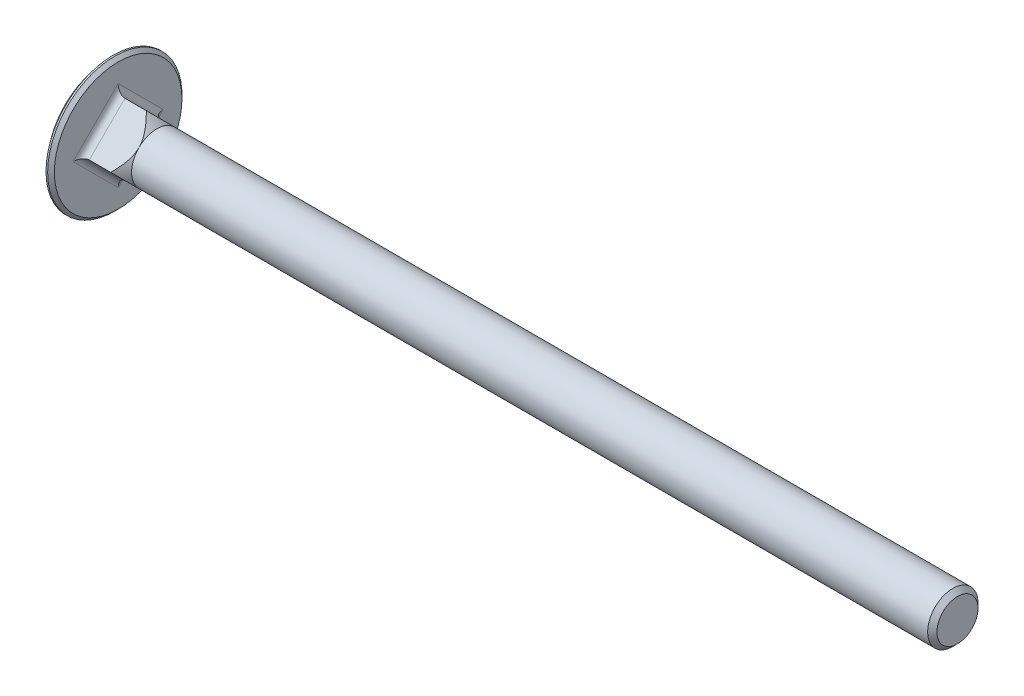
ISO-10303-21;
HEADER;
FILE_DESCRIPTION(('STEP AP214'),'2;1');
FILE_NAME('part.step','',(''),(''),'','','');
FILE_SCHEMA(('AUTOMOTIVE_DESIGN { 1 0 10303 214 1 1 1 1 }'));
ENDSEC;
DATA;
#1=APPLICATION_CONTEXT('core data for automotive mechanical design processes');
#2=APPLICATION_PROTOCOL_DEFINITION('international standard','automotive_design',2000,#1);
#3=PRODUCT_CONTEXT('',#1,'mechanical');
#4=PRODUCT('Part','Part','',(#3));
#5=PRODUCT_RELATED_PRODUCT_CATEGORY('part','',(#4));
#6=PRODUCT_DEFINITION_FORMATION('','',#4);
#7=PRODUCT_DEFINITION_CONTEXT('part definition',#1,'design');
#8=PRODUCT_DEFINITION('design','',#6,#7);
#9=PRODUCT_DEFINITION_SHAPE('','',#8);
#10=(LENGTH_UNIT() NAMED_UNIT(*) SI_UNIT(.MILLI.,.METRE.));
#11=(NAMED_UNIT(*) PLANE_ANGLE_UNIT() SI_UNIT($,.RADIAN.));
#12=(NAMED_UNIT(*) SI_UNIT($,.STERADIAN.) SOLID_ANGLE_UNIT());
#13=UNCERTAINTY_MEASURE_WITH_UNIT(LENGTH_MEASURE(1.E-05),#10,'distance_accuracy_value','');
#14=(GEOMETRIC_REPRESENTATION_CONTEXT(3) GLOBAL_UNCERTAINTY_ASSIGNED_CONTEXT((#13)) GLOBAL_UNIT_ASSIGNED_CONTEXT((#10,
#11,#12)) REPRESENTATION_CONTEXT('',''));
#15=CARTESIAN_POINT('',(0.,0.,0.));
#16=DIRECTION('',(0.,0.,1.));
#17=DIRECTION('',(1.,0.,0.));
#18=AXIS2_PLACEMENT_3D('',#15,#16,#17);
#19=CARTESIAN_POINT('',(-31.75,0.,0.));
#20=DIRECTION('',(-1.,0.,0.));
#21=DIRECTION('',(0.,0.,1.));
#22=AXIS2_PLACEMENT_3D('',#19,#20,#21);
#23=CYLINDRICAL_SURFACE('',#22,2.99999999999999);
#24=CARTESIAN_POINT('',(8.2,0.,0.));
#25=DIRECTION('',(-1.,0.,0.));
#26=DIRECTION('',(0.,0.,1.));
#27=AXIS2_PLACEMENT_3D('',#24,#25,#26);
#28=CIRCLE('',#27,2.99999999999999);
#29=CARTESIAN_POINT('',(8.2,2.12132034355964,2.12132034355964));
#30=VERTEX_POINT('',#29);
#31=CARTESIAN_POINT('',(8.2,-2.12132034355964,2.12132034355964));
#32=VERTEX_POINT('',#31);
#33=EDGE_CURVE('E130',#30,#32,#28,.F.);
#34=ORIENTED_EDGE('',*,*,#33,.T.);
#35=CARTESIAN_POINT('',(8.2,-2.12132034355964,-2.12132034355964));
#36=VERTEX_POINT('',#35);
#37=EDGE_CURVE('E140',#32,#36,#28,.F.);
#38=ORIENTED_EDGE('',*,*,#37,.T.);
#39=CARTESIAN_POINT('',(8.2,2.12132034355964,-2.12132034355964));
#40=VERTEX_POINT('',#39);
#41=EDGE_CURVE('E143',#36,#40,#28,.F.);
#42=ORIENTED_EDGE('',*,*,#41,.T.);
#43=EDGE_CURVE('E115',#40,#30,#28,.F.);
#44=ORIENTED_EDGE('',*,*,#43,.T.);
#45=EDGE_LOOP('',(#34,#38,#42,#44));
#46=FACE_BOUND('',#45,.T.);
#47=CARTESIAN_POINT('',(103.0455,0.,0.));
#48=DIRECTION('',(-1.,0.,0.));
#49=DIRECTION('',(0.,0.,1.));
#50=AXIS2_PLACEMENT_3D('',#47,#48,#49);
#51=CIRCLE('',#50,2.99999999999998);
#52=CARTESIAN_POINT('',(103.0455,0.,2.99999999999998));
#53=VERTEX_POINT('',#52);
#54=EDGE_CURVE('E285',#53,#53,#51,.T.);
#55=ORIENTED_EDGE('',*,*,#54,.T.);
#56=EDGE_LOOP('',(#55));
#57=FACE_BOUND('',#56,.T.);
#58=ADVANCED_FACE('F42',(#46,#57),#23,.T.);
#59=CARTESIAN_POINT('',(103.6,2.4455,0.));
#60=DIRECTION('',(1.,0.,0.));
#61=DIRECTION('',(0.,0.,-1.));
#62=AXIS2_PLACEMENT_3D('',#59,#60,#61);
#63=PLANE('',#62);
#64=CARTESIAN_POINT('',(103.6,0.,0.));
#65=DIRECTION('',(-1.,0.,0.));
#66=DIRECTION('',(0.,0.,1.));
#67=AXIS2_PLACEMENT_3D('',#64,#65,#66);
#68=CIRCLE('',#67,2.4455);
#69=CARTESIAN_POINT('',(103.6,0.,2.4455));
#70=VERTEX_POINT('',#69);
#71=EDGE_CURVE('E138',#70,#70,#68,.T.);
#72=ORIENTED_EDGE('',*,*,#71,.F.);
#73=EDGE_LOOP('',(#72));
#74=FACE_BOUND('',#73,.T.);
#75=ADVANCED_FACE('F206',(#74),#63,.T.);
#76=CARTESIAN_POINT('',(103.6,0.,0.));
#77=DIRECTION('',(-1.,0.,0.));
#78=DIRECTION('',(0.,0.,1.));
#79=AXIS2_PLACEMENT_3D('',#76,#77,#78);
#80=CONICAL_SURFACE('',#79,2.4455,0.785398163397419);
#81=ORIENTED_EDGE('',*,*,#54,.F.);
#82=EDGE_LOOP('',(#81));
#83=FACE_BOUND('',#82,.T.);
#84=ORIENTED_EDGE('',*,*,#71,.T.);
#85=EDGE_LOOP('',(#84));
#86=FACE_BOUND('',#85,.T.);
#87=ADVANCED_FACE('F211',(#83,#86),#80,.T.);
#88=CARTESIAN_POINT('',(2.20000000000002,0.,0.));
#89=DIRECTION('',(-1.,0.,0.));
#90=DIRECTION('',(0.,0.,1.));
#91=AXIS2_PLACEMENT_3D('',#88,#89,#90);
#92=CONICAL_SURFACE('',#91,9.,0.78539816339745);
#93=CARTESIAN_POINT('',(6.95715930816689,4.24284068711929,-0.000199999999999571));
#94=CARTESIAN_POINT('',(7.01643460291272,4.18354884947332,0.0590918376459672));
#95=CARTESIAN_POINT('',(7.07491232269781,4.123849261009,0.118791426110286));
#96=CARTESIAN_POINT('',(7.18989092946537,4.00346812939192,0.239172557727362));
#97=CARTESIAN_POINT('',(7.24639091590675,3.94278615684913,0.299854530270156));
#98=CARTESIAN_POINT('',(7.35766892755164,3.81956214384989,0.423078543269395));
#99=CARTESIAN_POINT('',(7.41241663337786,3.75700633775018,0.485634349369109));
#100=CARTESIAN_POINT('',(7.51886023106645,3.63061648575001,0.612024201369276));
#101=CARTESIAN_POINT('',(7.57055647160103,3.56678258700996,0.675858100109321));
#102=CARTESIAN_POINT('',(7.67174666983998,3.43562527527377,0.807015411845515));
#103=CARTESIAN_POINT('',(7.72112124590263,3.36825515972747,0.874385527391819));
#104=CARTESIAN_POINT('',(7.81485548466575,3.23180100313267,1.01083968398662));
#105=CARTESIAN_POINT('',(7.85921419481978,3.16271663956453,1.07992404755475));
#106=CARTESIAN_POINT('',(7.98248355046365,2.95331308578628,1.289327601333));
#107=CARTESIAN_POINT('',(8.05222972729531,2.81005176209045,1.43258892502884));
#108=CARTESIAN_POINT('',(8.12780049193547,2.59430729463026,1.64833339248902));
#109=CARTESIAN_POINT('',(8.14794262242049,2.52430014494078,1.7183405421785));
#110=CARTESIAN_POINT('',(8.17882887308437,2.38321062880929,1.85943005831));
#111=CARTESIAN_POINT('',(8.18957094130362,2.3121280310487,1.93051265607058));
#112=CARTESIAN_POINT('',(8.2008334522612,2.17055574380496,2.07208494331433));
#113=CARTESIAN_POINT('',(8.20149522498811,2.10007173273608,2.1425689543832));
#114=CARTESIAN_POINT('',(8.19291620035083,1.95941037804252,2.28323030907676));
#115=CARTESIAN_POINT('',(8.18367535606004,1.88923303587267,2.35340765124662));
#116=CARTESIAN_POINT('',(8.15600584917316,1.75030558303287,2.49233510408642));
#117=CARTESIAN_POINT('',(8.13764150446671,1.68154894205988,2.56109174505941));
#118=CARTESIAN_POINT('',(8.09279890784268,1.54534927741958,2.69729140969971));
#119=CARTESIAN_POINT('',(8.06631574532425,1.47790707510901,2.76473361201027));
#120=CARTESIAN_POINT('',(8.00608482010148,1.34372760816381,2.89891307895547));
#121=CARTESIAN_POINT('',(7.97224787918966,1.27701061273304,2.96563007438625));
#122=CARTESIAN_POINT('',(7.89876080414648,1.14522797402158,3.0974127130977));
#123=CARTESIAN_POINT('',(7.85911151529404,1.08016209223388,3.16247859488541));
#124=CARTESIAN_POINT('',(7.75757568127071,0.924792870769788,3.3178478163495));
#125=CARTESIAN_POINT('',(7.69330756858018,0.835271153647686,3.4073695334716));
#126=CARTESIAN_POINT('',(7.55770456538748,0.658912920654168,3.58372776646512));
#127=CARTESIAN_POINT('',(7.48636507333269,0.572078202151462,3.67056248496782));
#128=CARTESIAN_POINT('',(7.34065654968733,0.403299846098274,3.83934084102101));
#129=CARTESIAN_POINT('',(7.26644512123752,0.321287746779483,3.9213529403398));
#130=CARTESIAN_POINT('',(7.15234645891491,0.199689955696817,4.04295073142247));
#131=CARTESIAN_POINT('',(7.11388489137572,0.159428733989405,4.08321195312988));
#132=CARTESIAN_POINT('',(7.03612441479246,0.0793171961942268,4.16332349092506));
#133=CARTESIAN_POINT('',(6.99682557385314,0.0394668470739558,4.20317384004533));
#134=CARTESIAN_POINT('',(6.95715930816689,-0.00020000000000077,4.24284068711929));
#135=B_SPLINE_CURVE_WITH_KNOTS('',3,(#93,#94,#95,#96,#97,#98,#99,#100,#101,#102,#103,#104,#105,
#106,#107,#108,#109,#110,#111,#112,#113,#114,#115,#116,#117,#118,#119,#120,#121,#122,#123,#124,
#125,#126,#127,#128,#129,#130,#131,#132,#133,#134),.UNSPECIFIED.,.F.,.F.,(4,2,2,2,2,2,2,2,2,2,2,
2,2,2,2,2,2,2,2,2,4),(0.,0.308071452286483,0.616281403837969,0.928340708616832,1.24036428699253,
1.56214294853695,1.88398261573137,2.52380770468371,2.82653854831693,3.1293354592375,
3.42788305930369,3.72643207413549,4.02290565428026,4.31955890903334,4.62003321839452,
4.92046387360824,5.3460850582516,5.77198504828632,6.18496220263305,6.39108995770356,
6.59720100964495),.UNSPECIFIED.);
#136=CARTESIAN_POINT('',(6.95735931288072,0.,4.24264068711929));
#137=VERTEX_POINT('',#136);
#138=EDGE_CURVE('E125',#30,#137,#135,.T.);
#139=ORIENTED_EDGE('',*,*,#138,.T.);
#140=CARTESIAN_POINT('',(6.95715930816689,0.000199999999999906,4.24284068711929));
#141=CARTESIAN_POINT('',(7.01643460291272,-0.0590918376459671,4.18354884947332));
#142=CARTESIAN_POINT('',(7.07491232269781,-0.118791426110286,4.123849261009));
#143=CARTESIAN_POINT('',(7.18989092946537,-0.239172557727362,4.00346812939192));
#144=CARTESIAN_POINT('',(7.24639091590675,-0.299854530270155,3.94278615684913));
#145=CARTESIAN_POINT('',(7.35766892755164,-0.423078543269395,3.81956214384989));
#146=CARTESIAN_POINT('',(7.41241663337786,-0.485634349369109,3.75700633775018));
#147=CARTESIAN_POINT('',(7.51886023106644,-0.612024201369276,3.63061648575001));
#148=CARTESIAN_POINT('',(7.57055647160103,-0.675858100109322,3.56678258700996));
#149=CARTESIAN_POINT('',(7.67174666983998,-0.807015411845515,3.43562527527377));
#150=CARTESIAN_POINT('',(7.72112124590263,-0.874385527391819,3.36825515972747));
#151=CARTESIAN_POINT('',(7.81485548466575,-1.01083968398662,3.23180100313266));
#152=CARTESIAN_POINT('',(7.85921419481978,-1.07992404755475,3.16271663956453));
#153=CARTESIAN_POINT('',(7.98248355046365,-1.289327601333,2.95331308578628));
#154=CARTESIAN_POINT('',(8.05222972729531,-1.43258892502884,2.81005176209045));
#155=CARTESIAN_POINT('',(8.12780049193547,-1.64833339248902,2.59430729463026));
#156=CARTESIAN_POINT('',(8.14794262242049,-1.7183405421785,2.52430014494078));
#157=CARTESIAN_POINT('',(8.17882887308437,-1.85943005831,2.38321062880929));
#158=CARTESIAN_POINT('',(8.18957094130362,-1.93051265607058,2.3121280310487));
#159=CARTESIAN_POINT('',(8.2008334522612,-2.07208494331433,2.17055574380496));
#160=CARTESIAN_POINT('',(8.20149522498811,-2.1425689543832,2.10007173273608));
#161=CARTESIAN_POINT('',(8.19291620035083,-2.28323030907676,1.95941037804252));
#162=CARTESIAN_POINT('',(8.18367535606004,-2.35340765124662,1.88923303587267));
#163=CARTESIAN_POINT('',(8.15600584917316,-2.49233510408642,1.75030558303287));
#164=CARTESIAN_POINT('',(8.13764150446671,-2.56109174505941,1.68154894205988));
#165=CARTESIAN_POINT('',(8.09279890784268,-2.69729140969971,1.54534927741958));
#166=CARTESIAN_POINT('',(8.06631574532425,-2.76473361201027,1.47790707510901));
#167=CARTESIAN_POINT('',(8.00608482010148,-2.89891307895547,1.34372760816382));
#168=CARTESIAN_POINT('',(7.97224787918966,-2.96563007438625,1.27701061273304));
#169=CARTESIAN_POINT('',(7.89876080414648,-3.0974127130977,1.14522797402158));
#170=CARTESIAN_POINT('',(7.85911151529404,-3.16247859488541,1.08016209223388));
#171=CARTESIAN_POINT('',(7.75757568127071,-3.3178478163495,0.924792870769789));
#172=CARTESIAN_POINT('',(7.69330756858018,-3.4073695334716,0.835271153647687));
#173=CARTESIAN_POINT('',(7.55770456538749,-3.58372776646512,0.658912920654169));
#174=CARTESIAN_POINT('',(7.48636507333269,-3.67056248496782,0.572078202151462));
#175=CARTESIAN_POINT('',(7.34065654968733,-3.83934084102101,0.403299846098275));
#176=CARTESIAN_POINT('',(7.26644512123752,-3.9213529403398,0.321287746779484));
#177=CARTESIAN_POINT('',(7.15234645891491,-4.04295073142247,0.199689955696818));
#178=CARTESIAN_POINT('',(7.11388489137572,-4.08321195312988,0.159428733989406));
#179=CARTESIAN_POINT('',(7.03612441479246,-4.16332349092506,0.0793171961942277));
#180=CARTESIAN_POINT('',(6.99682557385314,-4.20317384004533,0.0394668470739564));
#181=CARTESIAN_POINT('',(6.95715930816689,-4.24284068711929,-0.000199999999999621));
#182=B_SPLINE_CURVE_WITH_KNOTS('',3,(#140,#141,#142,#143,#144,#145,#146,#147,#148,#149,#150,
#151,#152,#153,#154,#155,#156,#157,#158,#159,#160,#161,#162,#163,#164,#165,#166,#167,#168,#169,
#170,#171,#172,#173,#174,#175,#176,#177,#178,#179,#180,#181),.UNSPECIFIED.,.F.,.F.,(4,2,2,2,2,2,
2,2,2,2,2,2,2,2,2,2,2,2,2,2,4),(0.,0.308071452286484,0.61628140383797,0.928340708616833,
1.24036428699253,1.56214294853696,1.88398261573137,2.52380770468371,2.82653854831693,
3.1293354592375,3.42788305930369,3.72643207413549,4.02290565428026,4.31955890903334,
4.62003321839452,4.92046387360824,5.34608505825161,5.77198504828632,6.18496220263305,
6.39108995770356,6.59720100964495),.UNSPECIFIED.);
#183=EDGE_CURVE('E133',#137,#32,#182,.T.);
#184=ORIENTED_EDGE('',*,*,#183,.T.);
#185=ORIENTED_EDGE('',*,*,#33,.F.);
#186=EDGE_LOOP('',(#139,#184,#185));
#187=FACE_BOUND('',#186,.T.);
#188=ADVANCED_FACE('F131',(#187),#92,.T.);
#189=CARTESIAN_POINT('',(6.95735931288072,4.24264068711929,0.));
#190=VERTEX_POINT('',#189);
#191=EDGE_CURVE('E111',#190,#30,#135,.T.);
#192=ORIENTED_EDGE('',*,*,#191,.T.);
#193=ORIENTED_EDGE('',*,*,#43,.F.);
#194=CARTESIAN_POINT('',(6.95715930816689,-0.000200000000000094,-4.24284068711929));
#195=CARTESIAN_POINT('',(7.01643460291272,0.0590918376459666,-4.18354884947332));
#196=CARTESIAN_POINT('',(7.07491232269781,0.118791426110285,-4.123849261009));
#197=CARTESIAN_POINT('',(7.18989092946537,0.239172557727361,-4.00346812939192));
#198=CARTESIAN_POINT('',(7.24639091590675,0.299854530270155,-3.94278615684913));
#199=CARTESIAN_POINT('',(7.35766892755164,0.423078543269394,-3.81956214384989));
#200=CARTESIAN_POINT('',(7.41241663337786,0.485634349369109,-3.75700633775018));
#201=CARTESIAN_POINT('',(7.51886023106645,0.612024201369276,-3.63061648575001));
#202=CARTESIAN_POINT('',(7.57055647160103,0.675858100109321,-3.56678258700996));
#203=CARTESIAN_POINT('',(7.67174666983998,0.807015411845515,-3.43562527527377));
#204=CARTESIAN_POINT('',(7.72112124590263,0.874385527391819,-3.36825515972747));
#205=CARTESIAN_POINT('',(7.81485548466575,1.01083968398662,-3.23180100313267));
#206=CARTESIAN_POINT('',(7.85921419481978,1.07992404755475,-3.16271663956453));
#207=CARTESIAN_POINT('',(7.98248355046365,1.289327601333,-2.95331308578628));
#208=CARTESIAN_POINT('',(8.05222972729531,1.43258892502884,-2.81005176209045));
#209=CARTESIAN_POINT('',(8.12780049193547,1.64833339248902,-2.59430729463026));
#210=CARTESIAN_POINT('',(8.14794262242049,1.7183405421785,-2.52430014494078));
#211=CARTESIAN_POINT('',(8.17882887308437,1.85943005831,-2.38321062880929));
#212=CARTESIAN_POINT('',(8.18957094130362,1.93051265607058,-2.3121280310487));
#213=CARTESIAN_POINT('',(8.2008334522612,2.07208494331433,-2.17055574380496));
#214=CARTESIAN_POINT('',(8.20149522498811,2.1425689543832,-2.10007173273608));
#215=CARTESIAN_POINT('',(8.19291620035083,2.28323030907676,-1.95941037804252));
#216=CARTESIAN_POINT('',(8.18367535606004,2.35340765124662,-1.88923303587267));
#217=CARTESIAN_POINT('',(8.15600584917316,2.49233510408642,-1.75030558303287));
#218=CARTESIAN_POINT('',(8.13764150446671,2.56109174505941,-1.68154894205988));
#219=CARTESIAN_POINT('',(8.09279890784268,2.69729140969971,-1.54534927741958));
#220=CARTESIAN_POINT('',(8.06631574532425,2.76473361201027,-1.47790707510901));
#221=CARTESIAN_POINT('',(8.00608482010149,2.89891307895547,-1.34372760816381));
#222=CARTESIAN_POINT('',(7.97224787918966,2.96563007438625,-1.27701061273304));
#223=CARTESIAN_POINT('',(7.89876080414648,3.0974127130977,-1.14522797402158));
#224=CARTESIAN_POINT('',(7.85911151529403,3.16247859488541,-1.08016209223388));
#225=CARTESIAN_POINT('',(7.75757568127071,3.3178478163495,-0.924792870769789));
#226=CARTESIAN_POINT('',(7.69330756858018,3.4073695334716,-0.835271153647686));
#227=CARTESIAN_POINT('',(7.55770456538748,3.58372776646512,-0.658912920654168));
#228=CARTESIAN_POINT('',(7.48636507333269,3.67056248496782,-0.572078202151461));
#229=CARTESIAN_POINT('',(7.34065654968733,3.83934084102101,-0.403299846098274));
#230=CARTESIAN_POINT('',(7.26644512123752,3.9213529403398,-0.321287746779484));
#231=CARTESIAN_POINT('',(7.15234645891491,4.04295073142247,-0.199689955696818));
#232=CARTESIAN_POINT('',(7.11388489137572,4.08321195312988,-0.159428733989406));
#233=CARTESIAN_POINT('',(7.03612441479246,4.16332349092506,-0.0793171961942274));
#234=CARTESIAN_POINT('',(6.99682557385314,4.20317384004533,-0.0394668470739563));
#235=CARTESIAN_POINT('',(6.95715930816689,4.24284068711929,0.000199999999999894));
#236=B_SPLINE_CURVE_WITH_KNOTS('',3,(#194,#195,#196,#197,#198,#199,#200,#201,#202,#203,#204,
#205,#206,#207,#208,#209,#210,#211,#212,#213,#214,#215,#216,#217,#218,#219,#220,#221,#222,#223,
#224,#225,#226,#227,#228,#229,#230,#231,#232,#233,#234,#235),.UNSPECIFIED.,.F.,.F.,(4,2,2,2,2,2,
2,2,2,2,2,2,2,2,2,2,2,2,2,2,4),(0.,0.308071452286483,0.616281403837969,0.928340708616832,
1.24036428699253,1.56214294853696,1.88398261573137,2.52380770468371,2.82653854831693,
3.1293354592375,3.42788305930369,3.72643207413549,4.02290565428026,4.31955890903334,
4.62003321839452,4.92046387360824,5.34608505825161,5.77198504828632,6.18496220263305,
6.39108995770356,6.59720100964495),.UNSPECIFIED.);
#237=EDGE_CURVE('E118',#40,#190,#236,.T.);
#238=ORIENTED_EDGE('',*,*,#237,.T.);
#239=EDGE_LOOP('',(#192,#193,#238));
#240=FACE_BOUND('',#239,.T.);
#241=ADVANCED_FACE('F113',(#240),#92,.T.);
#242=CARTESIAN_POINT('',(6.95715930816689,-4.24284068711929,0.00019999999999968));
#243=CARTESIAN_POINT('',(7.01643460291272,-4.18354884947332,-0.0590918376459669));
#244=CARTESIAN_POINT('',(7.07491232269781,-4.123849261009,-0.118791426110286));
#245=CARTESIAN_POINT('',(7.18989092946537,-4.00346812939192,-0.239172557727362));
#246=CARTESIAN_POINT('',(7.24639091590675,-3.94278615684913,-0.299854530270156));
#247=CARTESIAN_POINT('',(7.35766892755165,-3.81956214384989,-0.423078543269395));
#248=CARTESIAN_POINT('',(7.41241663337786,-3.75700633775018,-0.485634349369109));
#249=CARTESIAN_POINT('',(7.51886023106645,-3.63061648575001,-0.612024201369276));
#250=CARTESIAN_POINT('',(7.57055647160104,-3.56678258700996,-0.675858100109322));
#251=CARTESIAN_POINT('',(7.67174666983998,-3.43562527527377,-0.807015411845516));
#252=CARTESIAN_POINT('',(7.72112124590263,-3.36825515972747,-0.87438552739182));
#253=CARTESIAN_POINT('',(7.81485548466575,-3.23180100313266,-1.01083968398662));
#254=CARTESIAN_POINT('',(7.85921419481978,-3.16271663956453,-1.07992404755475));
#255=CARTESIAN_POINT('',(7.98248355046365,-2.95331308578628,-1.289327601333));
#256=CARTESIAN_POINT('',(8.05222972729531,-2.81005176209045,-1.43258892502884));
#257=CARTESIAN_POINT('',(8.12780049193547,-2.59430729463026,-1.64833339248902));
#258=CARTESIAN_POINT('',(8.14794262242049,-2.52430014494078,-1.7183405421785));
#259=CARTESIAN_POINT('',(8.17882887308437,-2.38321062880929,-1.85943005831));
#260=CARTESIAN_POINT('',(8.18957094130362,-2.3121280310487,-1.93051265607058));
#261=CARTESIAN_POINT('',(8.2008334522612,-2.17055574380496,-2.07208494331433));
#262=CARTESIAN_POINT('',(8.20149522498811,-2.10007173273608,-2.1425689543832));
#263=CARTESIAN_POINT('',(8.19291620035082,-1.95941037804252,-2.28323030907676));
#264=CARTESIAN_POINT('',(8.18367535606004,-1.88923303587267,-2.35340765124662));
#265=CARTESIAN_POINT('',(8.15600584917316,-1.75030558303287,-2.49233510408642));
#266=CARTESIAN_POINT('',(8.13764150446671,-1.68154894205988,-2.56109174505941));
#267=CARTESIAN_POINT('',(8.09279890784268,-1.54534927741958,-2.69729140969971));
#268=CARTESIAN_POINT('',(8.06631574532425,-1.47790707510901,-2.76473361201027));
#269=CARTESIAN_POINT('',(8.00608482010148,-1.34372760816382,-2.89891307895547));
#270=CARTESIAN_POINT('',(7.97224787918966,-1.27701061273304,-2.96563007438625));
#271=CARTESIAN_POINT('',(7.89876080414648,-1.14522797402158,-3.0974127130977));
#272=CARTESIAN_POINT('',(7.85911151529404,-1.08016209223388,-3.16247859488541));
#273=CARTESIAN_POINT('',(7.75757568127071,-0.92479287076979,-3.3178478163495));
#274=CARTESIAN_POINT('',(7.69330756858018,-0.835271153647687,-3.4073695334716));
#275=CARTESIAN_POINT('',(7.55770456538749,-0.658912920654169,-3.58372776646512));
#276=CARTESIAN_POINT('',(7.48636507333269,-0.572078202151462,-3.67056248496782));
#277=CARTESIAN_POINT('',(7.34065654968733,-0.403299846098275,-3.83934084102101));
#278=CARTESIAN_POINT('',(7.26644512123752,-0.321287746779484,-3.9213529403398));
#279=CARTESIAN_POINT('',(7.15234645891491,-0.199689955696818,-4.04295073142247));
#280=CARTESIAN_POINT('',(7.11388489137572,-0.159428733989406,-4.08321195312988));
#281=CARTESIAN_POINT('',(7.03612441479246,-0.0793171961942273,-4.16332349092506));
#282=CARTESIAN_POINT('',(6.99682557385314,-0.0394668470739561,-4.20317384004533));
#283=CARTESIAN_POINT('',(6.95715930816689,0.000200000000000131,-4.24284068711929));
#284=B_SPLINE_CURVE_WITH_KNOTS('',3,(#242,#243,#244,#245,#246,#247,#248,#249,#250,#251,#252,
#253,#254,#255,#256,#257,#258,#259,#260,#261,#262,#263,#264,#265,#266,#267,#268,#269,#270,#271,
#272,#273,#274,#275,#276,#277,#278,#279,#280,#281,#282,#283),.UNSPECIFIED.,.F.,.F.,(4,2,2,2,2,2,
2,2,2,2,2,2,2,2,2,2,2,2,2,2,4),(0.,0.308071452286484,0.61628140383797,0.928340708616833,
1.24036428699253,1.56214294853696,1.88398261573137,2.52380770468371,2.82653854831693,
3.1293354592375,3.42788305930369,3.72643207413549,4.02290565428026,4.31955890903334,
4.62003321839452,4.92046387360824,5.3460850582516,5.77198504828632,6.18496220263305,
6.39108995770357,6.59720100964495),.UNSPECIFIED.);
#285=CARTESIAN_POINT('',(6.95735931288072,0.,-4.24264068711929));
#286=VERTEX_POINT('',#285);
#287=EDGE_CURVE('E188',#36,#286,#284,.T.);
#288=ORIENTED_EDGE('',*,*,#287,.T.);
#289=EDGE_CURVE('E195',#286,#40,#236,.T.);
#290=ORIENTED_EDGE('',*,*,#289,.T.);
#291=ORIENTED_EDGE('',*,*,#41,.F.);
#292=EDGE_LOOP('',(#288,#290,#291));
#293=FACE_BOUND('',#292,.T.);
#294=ADVANCED_FACE('F175',(#293),#92,.T.);
#295=CARTESIAN_POINT('',(6.95735931288072,-4.24264068711929,0.));
#296=VERTEX_POINT('',#295);
#297=EDGE_CURVE('E151',#32,#296,#182,.T.);
#298=ORIENTED_EDGE('',*,*,#297,.T.);
#299=EDGE_CURVE('E194',#296,#36,#284,.T.);
#300=ORIENTED_EDGE('',*,*,#299,.T.);
#301=ORIENTED_EDGE('',*,*,#37,.F.);
#302=EDGE_LOOP('',(#298,#300,#301));
#303=FACE_BOUND('',#302,.T.);
#304=ADVANCED_FACE('F308',(#303),#92,.T.);
#305=CARTESIAN_POINT('',(3.6,8.,0.));
#306=DIRECTION('',(1.,0.,0.));
#307=DIRECTION('',(0.,0.,-1.));
#308=AXIS2_PLACEMENT_3D('',#305,#306,#307);
#309=PLANE('',#308);
#310=DIRECTION('',(0.,0.707106781186548,0.707106781186548));
#311=VECTOR('',#310,1.);
#312=CARTESIAN_POINT('',(3.6,1.31299423149112,6.68700576850888));
#313=LINE('',#312,#311);
#314=CARTESIAN_POINT('',(3.6,-5.37401153701776,0.));
#315=VERTEX_POINT('',#314);
#316=CARTESIAN_POINT('',(3.6,0.,5.37401153701776));
#317=VERTEX_POINT('',#316);
#318=EDGE_CURVE('E242',#315,#317,#313,.T.);
#319=ORIENTED_EDGE('',*,*,#318,.T.);
#320=DIRECTION('',(0.,0.707106781186548,-0.707106781186548));
#321=VECTOR('',#320,1.);
#322=CARTESIAN_POINT('',(3.6,6.68700576850888,-1.31299423149112));
#323=LINE('',#322,#321);
#324=CARTESIAN_POINT('',(3.6,5.37401153701776,0.));
#325=VERTEX_POINT('',#324);
#326=EDGE_CURVE('E270',#317,#325,#323,.T.);
#327=ORIENTED_EDGE('',*,*,#326,.T.);
#328=DIRECTION('',(0.,-0.707106781186548,-0.707106781186548));
#329=VECTOR('',#328,1.);
#330=CARTESIAN_POINT('',(3.6,6.68700576850888,1.31299423149112));
#331=LINE('',#330,#329);
#332=CARTESIAN_POINT('',(3.6,0.,-5.37401153701776));
#333=VERTEX_POINT('',#332);
#334=EDGE_CURVE('E279',#325,#333,#331,.T.);
#335=ORIENTED_EDGE('',*,*,#334,.T.);
#336=DIRECTION('',(0.,-0.707106781186548,0.707106781186548));
#337=VECTOR('',#336,1.);
#338=CARTESIAN_POINT('',(3.6,1.31299423149112,-6.68700576850888));
#339=LINE('',#338,#337);
#340=EDGE_CURVE('E276',#333,#315,#339,.T.);
#341=ORIENTED_EDGE('',*,*,#340,.T.);
#342=EDGE_LOOP('',(#319,#327,#335,#341));
#343=FACE_BOUND('',#342,.T.);
#344=CARTESIAN_POINT('',(3.6,0.,0.));
#345=DIRECTION('',(1.,0.,0.));
#346=DIRECTION('',(0.,0.,-1.));
#347=AXIS2_PLACEMENT_3D('',#344,#345,#346);
#348=CIRCLE('',#347,7.60000000000002);
#349=CARTESIAN_POINT('',(3.6,0.,-7.60000000000002));
#350=VERTEX_POINT('',#349);
#351=EDGE_CURVE('E245',#350,#350,#348,.T.);
#352=ORIENTED_EDGE('',*,*,#351,.T.);
#353=EDGE_LOOP('',(#352));
#354=FACE_BOUND('',#353,.T.);
#355=ADVANCED_FACE('F216',(#343,#354),#309,.T.);
#356=CARTESIAN_POINT('',(8.2,4.24264068711929,0.));
#357=DIRECTION('',(0.,-0.707106781186547,0.707106781186547));
#358=DIRECTION('',(0.,-0.707106781186548,-0.707106781186548));
#359=AXIS2_PLACEMENT_3D('',#356,#357,#358);
#360=PLANE('',#359);
#361=DIRECTION('',(-1.,0.,0.));
#362=VECTOR('',#361,1.);
#363=CARTESIAN_POINT('',(8.2,0.,-4.24264068711929));
#364=LINE('',#363,#362);
#365=CARTESIAN_POINT('',(4.4,0.,-4.24264068711929));
#366=VERTEX_POINT('',#365);
#367=EDGE_CURVE('E297',#286,#366,#364,.T.);
#368=ORIENTED_EDGE('',*,*,#367,.T.);
#369=DIRECTION('',(0.,-0.707106781186548,-0.707106781186548));
#370=VECTOR('',#369,1.);
#371=CARTESIAN_POINT('',(4.4,4.24264068711929,0.));
#372=LINE('',#371,#370);
#373=CARTESIAN_POINT('',(4.4,4.24264068711929,0.));
#374=VERTEX_POINT('',#373);
#375=EDGE_CURVE('E12',#366,#374,#372,.F.);
#376=ORIENTED_EDGE('',*,*,#375,.T.);
#377=DIRECTION('',(-1.,0.,0.));
#378=VECTOR('',#377,1.);
#379=CARTESIAN_POINT('',(8.2,4.24264068711929,0.));
#380=LINE('',#379,#378);
#381=EDGE_CURVE('E124',#190,#374,#380,.T.);
#382=ORIENTED_EDGE('',*,*,#381,.F.);
#383=ORIENTED_EDGE('',*,*,#237,.F.);
#384=ORIENTED_EDGE('',*,*,#289,.F.);
#385=EDGE_LOOP('',(#368,#376,#382,#383,#384));
#386=FACE_BOUND('',#385,.T.);
#387=ADVANCED_FACE('F176',(#386),#360,.F.);
#388=CARTESIAN_POINT('',(8.2,0.,-4.24264068711929));
#389=DIRECTION('',(0.,0.707106781186547,0.707106781186547));
#390=DIRECTION('',(0.,-0.707106781186548,0.707106781186548));
#391=AXIS2_PLACEMENT_3D('',#388,#389,#390);
#392=PLANE('',#391);
#393=DIRECTION('',(-1.,0.,0.));
#394=VECTOR('',#393,1.);
#395=CARTESIAN_POINT('',(8.2,-4.24264068711929,0.));
#396=LINE('',#395,#394);
#397=CARTESIAN_POINT('',(4.4,-4.24264068711929,0.));
#398=VERTEX_POINT('',#397);
#399=EDGE_CURVE('E295',#296,#398,#396,.T.);
#400=ORIENTED_EDGE('',*,*,#399,.T.);
#401=DIRECTION('',(0.,-0.707106781186548,0.707106781186548));
#402=VECTOR('',#401,1.);
#403=CARTESIAN_POINT('',(4.4,0.,-4.24264068711929));
#404=LINE('',#403,#402);
#405=EDGE_CURVE('E52',#398,#366,#404,.F.);
#406=ORIENTED_EDGE('',*,*,#405,.T.);
#407=ORIENTED_EDGE('',*,*,#367,.F.);
#408=ORIENTED_EDGE('',*,*,#287,.F.);
#409=ORIENTED_EDGE('',*,*,#299,.F.);
#410=EDGE_LOOP('',(#400,#406,#407,#408,#409));
#411=FACE_BOUND('',#410,.T.);
#412=ADVANCED_FACE('F196',(#411),#392,.F.);
#413=CARTESIAN_POINT('',(8.2,-4.24264068711929,0.));
#414=DIRECTION('',(0.,0.707106781186547,-0.707106781186547));
#415=DIRECTION('',(0.,0.707106781186548,0.707106781186548));
#416=AXIS2_PLACEMENT_3D('',#413,#414,#415);
#417=PLANE('',#416);
#418=DIRECTION('',(-1.,0.,0.));
#419=VECTOR('',#418,1.);
#420=CARTESIAN_POINT('',(8.2,0.,4.24264068711929));
#421=LINE('',#420,#419);
#422=CARTESIAN_POINT('',(4.4,0.,4.24264068711929));
#423=VERTEX_POINT('',#422);
#424=EDGE_CURVE('E148',#137,#423,#421,.T.);
#425=ORIENTED_EDGE('',*,*,#424,.T.);
#426=DIRECTION('',(0.,0.707106781186548,0.707106781186548));
#427=VECTOR('',#426,1.);
#428=CARTESIAN_POINT('',(4.4,-4.24264068711929,0.));
#429=LINE('',#428,#427);
#430=EDGE_CURVE('E67',#423,#398,#429,.F.);
#431=ORIENTED_EDGE('',*,*,#430,.T.);
#432=ORIENTED_EDGE('',*,*,#399,.F.);
#433=ORIENTED_EDGE('',*,*,#297,.F.);
#434=ORIENTED_EDGE('',*,*,#183,.F.);
#435=EDGE_LOOP('',(#425,#431,#432,#433,#434));
#436=FACE_BOUND('',#435,.T.);
#437=ADVANCED_FACE('F199',(#436),#417,.F.);
#438=CARTESIAN_POINT('',(8.2,0.,4.24264068711929));
#439=DIRECTION('',(0.,-0.707106781186547,-0.707106781186547));
#440=DIRECTION('',(0.,0.707106781186548,-0.707106781186548));
#441=AXIS2_PLACEMENT_3D('',#438,#439,#440);
#442=PLANE('',#441);
#443=ORIENTED_EDGE('',*,*,#381,.T.);
#444=DIRECTION('',(0.,0.707106781186548,-0.707106781186548));
#445=VECTOR('',#444,1.);
#446=CARTESIAN_POINT('',(4.4,0.,4.24264068711929));
#447=LINE('',#446,#445);
#448=EDGE_CURVE('E267',#374,#423,#447,.F.);
#449=ORIENTED_EDGE('',*,*,#448,.T.);
#450=ORIENTED_EDGE('',*,*,#424,.F.);
#451=ORIENTED_EDGE('',*,*,#138,.F.);
#452=ORIENTED_EDGE('',*,*,#191,.F.);
#453=EDGE_LOOP('',(#443,#449,#450,#451,#452));
#454=FACE_BOUND('',#453,.T.);
#455=ADVANCED_FACE('F146',(#454),#442,.F.);
#456=CARTESIAN_POINT('',(3.20000000000002,0.,0.));
#457=DIRECTION('',(-1.,0.,0.));
#458=DIRECTION('',(0.,0.,1.));
#459=AXIS2_PLACEMENT_3D('',#456,#457,#458);
#460=CIRCLE('',#459,8.);
#461=CARTESIAN_POINT('',(3.20000000000002,0.,8.));
#462=VERTEX_POINT('',#461);
#463=EDGE_CURVE('E250',#462,#462,#460,.T.);
#464=ORIENTED_EDGE('',*,*,#463,.F.);
#465=EDGE_LOOP('',(#464));
#466=FACE_BOUND('',#465,.T.);
#467=ORIENTED_EDGE('',*,*,#351,.F.);
#468=EDGE_LOOP('',(#467));
#469=FACE_BOUND('',#468,.T.);
#470=ADVANCED_FACE('F169',(#466,#469),#92,.T.);
#471=CARTESIAN_POINT('',(12.1593401545431,0.,0.));
#472=DIRECTION('',(-1.,0.,0.));
#473=DIRECTION('',(0.,1.,0.));
#474=AXIS2_PLACEMENT_3D('',#471,#472,#473);
#475=SPHERICAL_SURFACE('',#474,12.1593401545431);
#476=CARTESIAN_POINT('',(3.0024,0.,0.));
#477=DIRECTION('',(-1.,0.,0.));
#478=DIRECTION('',(0.,0.,1.));
#479=AXIS2_PLACEMENT_3D('',#476,#477,#478);
#480=CIRCLE('',#479,8.);
#481=CARTESIAN_POINT('',(3.0024,0.,8.));
#482=VERTEX_POINT('',#481);
#483=EDGE_CURVE('E289',#482,#482,#480,.T.);
#484=ORIENTED_EDGE('',*,*,#483,.T.);
#485=EDGE_LOOP('',(#484));
#486=FACE_BOUND('',#485,.T.);
#487=ADVANCED_FACE('F173',(#486),#475,.T.);
#488=CARTESIAN_POINT('',(-31.75,0.,0.));
#489=DIRECTION('',(-1.,0.,0.));
#490=DIRECTION('',(0.,0.,1.));
#491=AXIS2_PLACEMENT_3D('',#488,#489,#490);
#492=CYLINDRICAL_SURFACE('',#491,8.);
#493=ORIENTED_EDGE('',*,*,#483,.F.);
#494=EDGE_LOOP('',(#493));
#495=FACE_BOUND('',#494,.T.);
#496=ORIENTED_EDGE('',*,*,#463,.T.);
#497=EDGE_LOOP('',(#496));
#498=FACE_BOUND('',#497,.T.);
#499=ADVANCED_FACE('F222',(#495,#498),#492,.T.);
#500=CARTESIAN_POINT('',(4.4,1.31299423149112,-6.68700576850888));
#501=DIRECTION('',(0.,-0.707106781186548,0.707106781186548));
#502=DIRECTION('',(0.,-0.707106781186548,-0.707106781186548));
#503=AXIS2_PLACEMENT_3D('',#500,#501,#502);
#504=CYLINDRICAL_SURFACE('',#503,0.8);
#505=CARTESIAN_POINT('',(4.4,0.,-5.37401153701776));
#506=DIRECTION('',(0.,-1.,0.));
#507=DIRECTION('',(0.,0.,-1.));
#508=AXIS2_PLACEMENT_3D('',#505,#506,#507);
#509=ELLIPSE('',#508,1.13137084989848,0.8);
#510=EDGE_CURVE('E246',#366,#333,#509,.T.);
#511=ORIENTED_EDGE('',*,*,#510,.F.);
#512=ORIENTED_EDGE('',*,*,#405,.F.);
#513=CARTESIAN_POINT('',(4.4,-5.37401153701776,0.));
#514=DIRECTION('',(0.,0.,1.));
#515=DIRECTION('',(0.,-1.,0.));
#516=AXIS2_PLACEMENT_3D('',#513,#514,#515);
#517=ELLIPSE('',#516,1.13137084989848,0.8);
#518=EDGE_CURVE('E46',#315,#398,#517,.F.);
#519=ORIENTED_EDGE('',*,*,#518,.F.);
#520=ORIENTED_EDGE('',*,*,#340,.F.);
#521=EDGE_LOOP('',(#511,#512,#519,#520));
#522=FACE_BOUND('',#521,.T.);
#523=ADVANCED_FACE('F44',(#522),#504,.F.);
#524=CARTESIAN_POINT('',(4.4,1.31299423149112,6.68700576850888));
#525=DIRECTION('',(0.,0.707106781186548,0.707106781186548));
#526=DIRECTION('',(0.,-0.707106781186548,0.707106781186548));
#527=AXIS2_PLACEMENT_3D('',#524,#525,#526);
#528=CYLINDRICAL_SURFACE('',#527,0.8);
#529=ORIENTED_EDGE('',*,*,#518,.T.);
#530=ORIENTED_EDGE('',*,*,#430,.F.);
#531=CARTESIAN_POINT('',(4.4,0.,5.37401153701776));
#532=DIRECTION('',(0.,1.,0.));
#533=DIRECTION('',(0.,0.,1.));
#534=AXIS2_PLACEMENT_3D('',#531,#532,#533);
#535=ELLIPSE('',#534,1.13137084989848,0.8);
#536=EDGE_CURVE('E253',#317,#423,#535,.F.);
#537=ORIENTED_EDGE('',*,*,#536,.F.);
#538=ORIENTED_EDGE('',*,*,#318,.F.);
#539=EDGE_LOOP('',(#529,#530,#537,#538));
#540=FACE_BOUND('',#539,.T.);
#541=ADVANCED_FACE('F230',(#540),#528,.F.);
#542=CARTESIAN_POINT('',(4.4,6.68700576850888,1.31299423149112));
#543=DIRECTION('',(0.,-0.707106781186548,-0.707106781186548));
#544=DIRECTION('',(0.,0.707106781186548,-0.707106781186548));
#545=AXIS2_PLACEMENT_3D('',#542,#543,#544);
#546=CYLINDRICAL_SURFACE('',#545,0.8);
#547=ORIENTED_EDGE('',*,*,#510,.T.);
#548=ORIENTED_EDGE('',*,*,#334,.F.);
#549=CARTESIAN_POINT('',(4.4,5.37401153701776,0.));
#550=DIRECTION('',(0.,0.,-1.));
#551=DIRECTION('',(0.,-1.,0.));
#552=AXIS2_PLACEMENT_3D('',#549,#550,#551);
#553=ELLIPSE('',#552,1.13137084989848,0.8);
#554=EDGE_CURVE('E258',#374,#325,#553,.T.);
#555=ORIENTED_EDGE('',*,*,#554,.F.);
#556=ORIENTED_EDGE('',*,*,#375,.F.);
#557=EDGE_LOOP('',(#547,#548,#555,#556));
#558=FACE_BOUND('',#557,.T.);
#559=ADVANCED_FACE('F227',(#558),#546,.F.);
#560=CARTESIAN_POINT('',(4.4,6.68700576850888,-1.31299423149112));
#561=DIRECTION('',(0.,0.707106781186548,-0.707106781186548));
#562=DIRECTION('',(0.,0.707106781186548,0.707106781186548));
#563=AXIS2_PLACEMENT_3D('',#560,#561,#562);
#564=CYLINDRICAL_SURFACE('',#563,0.8);
#565=ORIENTED_EDGE('',*,*,#536,.T.);
#566=ORIENTED_EDGE('',*,*,#448,.F.);
#567=ORIENTED_EDGE('',*,*,#554,.T.);
#568=ORIENTED_EDGE('',*,*,#326,.F.);
#569=EDGE_LOOP('',(#565,#566,#567,#568));
#570=FACE_BOUND('',#569,.T.);
#571=ADVANCED_FACE('F224',(#570),#564,.F.);
#572=CLOSED_SHELL('',(#58,#75,#87,#188,#241,#294,#304,#355,#387,#412,#437,#455,#470,#487,#499,
#523,#541,#559,#571));
#573=MANIFOLD_SOLID_BREP('B2',#572);
#574=ADVANCED_BREP_SHAPE_REPRESENTATION('',(#18,#573),#14);
#575=SHAPE_DEFINITION_REPRESENTATION(#9,#574);
ENDSEC;
END-ISO-10303-21;
